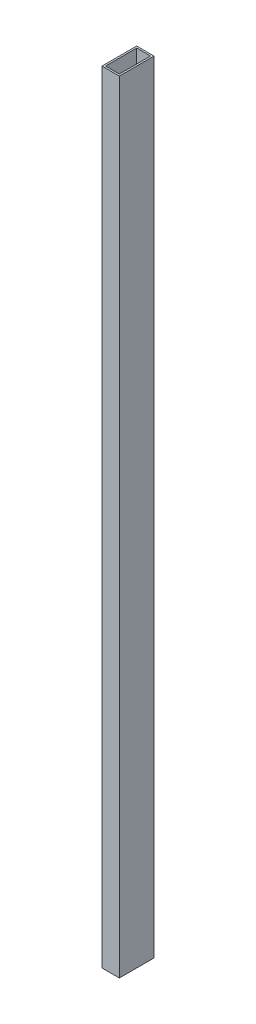
ISO-10303-21;
HEADER;
FILE_DESCRIPTION(('STEP AP214'),'2;1');
FILE_NAME('part.step','',(''),(''),'','','');
FILE_SCHEMA(('AUTOMOTIVE_DESIGN { 1 0 10303 214 1 1 1 1 }'));
ENDSEC;
DATA;
#1=APPLICATION_CONTEXT('core data for automotive mechanical design processes');
#2=APPLICATION_PROTOCOL_DEFINITION('international standard','automotive_design',2000,#1);
#3=PRODUCT_CONTEXT('',#1,'mechanical');
#4=PRODUCT('Part','Part','',(#3));
#5=PRODUCT_RELATED_PRODUCT_CATEGORY('part','',(#4));
#6=PRODUCT_DEFINITION_FORMATION('','',#4);
#7=PRODUCT_DEFINITION_CONTEXT('part definition',#1,'design');
#8=PRODUCT_DEFINITION('design','',#6,#7);
#9=PRODUCT_DEFINITION_SHAPE('','',#8);
#10=(LENGTH_UNIT() NAMED_UNIT(*) SI_UNIT(.MILLI.,.METRE.));
#11=(NAMED_UNIT(*) PLANE_ANGLE_UNIT() SI_UNIT($,.RADIAN.));
#12=(NAMED_UNIT(*) SI_UNIT($,.STERADIAN.) SOLID_ANGLE_UNIT());
#13=UNCERTAINTY_MEASURE_WITH_UNIT(LENGTH_MEASURE(1.E-05),#10,'distance_accuracy_value','');
#14=(GEOMETRIC_REPRESENTATION_CONTEXT(3) GLOBAL_UNCERTAINTY_ASSIGNED_CONTEXT((#13)) GLOBAL_UNIT_ASSIGNED_CONTEXT((#10,
#11,#12)) REPRESENTATION_CONTEXT('',''));
#15=CARTESIAN_POINT('',(0.,0.,0.));
#16=DIRECTION('',(0.,0.,1.));
#17=DIRECTION('',(1.,0.,0.));
#18=AXIS2_PLACEMENT_3D('',#15,#16,#17);
#19=CARTESIAN_POINT('',(0.,450.,0.));
#20=DIRECTION('',(0.,1.,0.));
#21=DIRECTION('',(0.,0.,1.));
#22=AXIS2_PLACEMENT_3D('',#19,#20,#21);
#23=PLANE('',#22);
#24=DIRECTION('',(0.,0.,1.));
#25=VECTOR('',#24,1.);
#26=CARTESIAN_POINT('',(-5.,450.,10.));
#27=LINE('',#26,#25);
#28=CARTESIAN_POINT('',(-5.,450.,-9.99999999999999));
#29=VERTEX_POINT('',#28);
#30=CARTESIAN_POINT('',(-5.,450.,10.));
#31=VERTEX_POINT('',#30);
#32=EDGE_CURVE('E136',#29,#31,#27,.T.);
#33=ORIENTED_EDGE('',*,*,#32,.T.);
#34=DIRECTION('',(1.,0.,0.));
#35=VECTOR('',#34,1.);
#36=CARTESIAN_POINT('',(5.,450.,10.));
#37=LINE('',#36,#35);
#38=CARTESIAN_POINT('',(5.,450.,10.));
#39=VERTEX_POINT('',#38);
#40=EDGE_CURVE('E139',#31,#39,#37,.T.);
#41=ORIENTED_EDGE('',*,*,#40,.T.);
#42=DIRECTION('',(0.,0.,-1.));
#43=VECTOR('',#42,1.);
#44=CARTESIAN_POINT('',(5.,450.,10.));
#45=LINE('',#44,#43);
#46=CARTESIAN_POINT('',(5.,450.,-10.));
#47=VERTEX_POINT('',#46);
#48=EDGE_CURVE('E142',#39,#47,#45,.T.);
#49=ORIENTED_EDGE('',*,*,#48,.T.);
#50=DIRECTION('',(-1.,0.,0.));
#51=VECTOR('',#50,1.);
#52=CARTESIAN_POINT('',(5.,450.,-10.));
#53=LINE('',#52,#51);
#54=EDGE_CURVE('E144',#47,#29,#53,.T.);
#55=ORIENTED_EDGE('',*,*,#54,.T.);
#56=EDGE_LOOP('',(#33,#41,#49,#55));
#57=FACE_BOUND('',#56,.T.);
#58=DIRECTION('',(1.,0.,0.));
#59=VECTOR('',#58,1.);
#60=CARTESIAN_POINT('',(4.,450.,9.));
#61=LINE('',#60,#59);
#62=CARTESIAN_POINT('',(-4.,450.,9.));
#63=VERTEX_POINT('',#62);
#64=CARTESIAN_POINT('',(4.,450.,9.));
#65=VERTEX_POINT('',#64);
#66=EDGE_CURVE('E108',#63,#65,#61,.T.);
#67=ORIENTED_EDGE('',*,*,#66,.F.);
#68=DIRECTION('',(0.,0.,1.));
#69=VECTOR('',#68,1.);
#70=CARTESIAN_POINT('',(-4.,450.,9.));
#71=LINE('',#70,#69);
#72=CARTESIAN_POINT('',(-4.,450.,-9.));
#73=VERTEX_POINT('',#72);
#74=EDGE_CURVE('E100',#73,#63,#71,.T.);
#75=ORIENTED_EDGE('',*,*,#74,.F.);
#76=DIRECTION('',(-1.,0.,0.));
#77=VECTOR('',#76,1.);
#78=CARTESIAN_POINT('',(4.,450.,-9.));
#79=LINE('',#78,#77);
#80=CARTESIAN_POINT('',(4.,450.,-9.));
#81=VERTEX_POINT('',#80);
#82=EDGE_CURVE('E122',#81,#73,#79,.T.);
#83=ORIENTED_EDGE('',*,*,#82,.F.);
#84=DIRECTION('',(0.,0.,-1.));
#85=VECTOR('',#84,1.);
#86=CARTESIAN_POINT('',(4.,450.,9.));
#87=LINE('',#86,#85);
#88=EDGE_CURVE('E120',#65,#81,#87,.T.);
#89=ORIENTED_EDGE('',*,*,#88,.F.);
#90=EDGE_LOOP('',(#67,#75,#83,#89));
#91=FACE_BOUND('',#90,.T.);
#92=ADVANCED_FACE('F35',(#57,#91),#23,.T.);
#93=CARTESIAN_POINT('',(0.,0.,0.));
#94=DIRECTION('',(0.,1.,0.));
#95=DIRECTION('',(0.,0.,1.));
#96=AXIS2_PLACEMENT_3D('',#93,#94,#95);
#97=PLANE('',#96);
#98=DIRECTION('',(0.,0.,1.));
#99=VECTOR('',#98,1.);
#100=CARTESIAN_POINT('',(-5.,0.,10.));
#101=LINE('',#100,#99);
#102=CARTESIAN_POINT('',(-5.,0.,-9.99999999999999));
#103=VERTEX_POINT('',#102);
#104=CARTESIAN_POINT('',(-5.,0.,10.));
#105=VERTEX_POINT('',#104);
#106=EDGE_CURVE('E116',#103,#105,#101,.T.);
#107=ORIENTED_EDGE('',*,*,#106,.F.);
#108=DIRECTION('',(-1.,0.,0.));
#109=VECTOR('',#108,1.);
#110=CARTESIAN_POINT('',(5.,0.,-10.));
#111=LINE('',#110,#109);
#112=CARTESIAN_POINT('',(5.,0.,-10.));
#113=VERTEX_POINT('',#112);
#114=EDGE_CURVE('E140',#113,#103,#111,.T.);
#115=ORIENTED_EDGE('',*,*,#114,.F.);
#116=DIRECTION('',(0.,0.,-1.));
#117=VECTOR('',#116,1.);
#118=CARTESIAN_POINT('',(5.,0.,10.));
#119=LINE('',#118,#117);
#120=CARTESIAN_POINT('',(5.,0.,10.));
#121=VERTEX_POINT('',#120);
#122=EDGE_CURVE('E151',#121,#113,#119,.T.);
#123=ORIENTED_EDGE('',*,*,#122,.F.);
#124=DIRECTION('',(1.,0.,0.));
#125=VECTOR('',#124,1.);
#126=CARTESIAN_POINT('',(5.,0.,10.));
#127=LINE('',#126,#125);
#128=EDGE_CURVE('E149',#105,#121,#127,.T.);
#129=ORIENTED_EDGE('',*,*,#128,.F.);
#130=EDGE_LOOP('',(#107,#115,#123,#129));
#131=FACE_BOUND('',#130,.T.);
#132=DIRECTION('',(0.,0.,1.));
#133=VECTOR('',#132,1.);
#134=CARTESIAN_POINT('',(-4.,0.,9.));
#135=LINE('',#134,#133);
#136=CARTESIAN_POINT('',(-4.,0.,-9.));
#137=VERTEX_POINT('',#136);
#138=CARTESIAN_POINT('',(-4.,0.,9.));
#139=VERTEX_POINT('',#138);
#140=EDGE_CURVE('E58',#137,#139,#135,.T.);
#141=ORIENTED_EDGE('',*,*,#140,.T.);
#142=DIRECTION('',(1.,0.,0.));
#143=VECTOR('',#142,1.);
#144=CARTESIAN_POINT('',(4.,0.,9.));
#145=LINE('',#144,#143);
#146=CARTESIAN_POINT('',(4.,0.,9.));
#147=VERTEX_POINT('',#146);
#148=EDGE_CURVE('E115',#139,#147,#145,.T.);
#149=ORIENTED_EDGE('',*,*,#148,.T.);
#150=DIRECTION('',(0.,0.,-1.));
#151=VECTOR('',#150,1.);
#152=CARTESIAN_POINT('',(4.,0.,9.));
#153=LINE('',#152,#151);
#154=CARTESIAN_POINT('',(4.,0.,-9.));
#155=VERTEX_POINT('',#154);
#156=EDGE_CURVE('E128',#147,#155,#153,.T.);
#157=ORIENTED_EDGE('',*,*,#156,.T.);
#158=DIRECTION('',(-1.,0.,0.));
#159=VECTOR('',#158,1.);
#160=CARTESIAN_POINT('',(4.,0.,-9.));
#161=LINE('',#160,#159);
#162=EDGE_CURVE('E109',#155,#137,#161,.T.);
#163=ORIENTED_EDGE('',*,*,#162,.T.);
#164=EDGE_LOOP('',(#141,#149,#157,#163));
#165=FACE_BOUND('',#164,.T.);
#166=ADVANCED_FACE('F169',(#131,#165),#97,.F.);
#167=CARTESIAN_POINT('',(-5.,450.,10.));
#168=DIRECTION('',(1.,0.,0.));
#169=DIRECTION('',(0.,0.,-1.));
#170=AXIS2_PLACEMENT_3D('',#167,#168,#169);
#171=PLANE('',#170);
#172=ORIENTED_EDGE('',*,*,#106,.T.);
#173=DIRECTION('',(0.,-1.,0.));
#174=VECTOR('',#173,1.);
#175=CARTESIAN_POINT('',(-5.,450.,10.));
#176=LINE('',#175,#174);
#177=EDGE_CURVE('E11',#31,#105,#176,.T.);
#178=ORIENTED_EDGE('',*,*,#177,.F.);
#179=ORIENTED_EDGE('',*,*,#32,.F.);
#180=DIRECTION('',(0.,-1.,0.));
#181=VECTOR('',#180,1.);
#182=CARTESIAN_POINT('',(-5.,450.,-9.99999999999999));
#183=LINE('',#182,#181);
#184=EDGE_CURVE('E146',#29,#103,#183,.T.);
#185=ORIENTED_EDGE('',*,*,#184,.T.);
#186=EDGE_LOOP('',(#172,#178,#179,#185));
#187=FACE_BOUND('',#186,.T.);
#188=ADVANCED_FACE('F37',(#187),#171,.F.);
#189=CARTESIAN_POINT('',(5.,450.,10.));
#190=DIRECTION('',(0.,0.,-1.));
#191=DIRECTION('',(-1.,0.,0.));
#192=AXIS2_PLACEMENT_3D('',#189,#190,#191);
#193=PLANE('',#192);
#194=ORIENTED_EDGE('',*,*,#128,.T.);
#195=DIRECTION('',(0.,-1.,0.));
#196=VECTOR('',#195,1.);
#197=CARTESIAN_POINT('',(5.,450.,10.));
#198=LINE('',#197,#196);
#199=EDGE_CURVE('E43',#39,#121,#198,.T.);
#200=ORIENTED_EDGE('',*,*,#199,.F.);
#201=ORIENTED_EDGE('',*,*,#40,.F.);
#202=ORIENTED_EDGE('',*,*,#177,.T.);
#203=EDGE_LOOP('',(#194,#200,#201,#202));
#204=FACE_BOUND('',#203,.T.);
#205=ADVANCED_FACE('F179',(#204),#193,.F.);
#206=CARTESIAN_POINT('',(5.,450.,10.));
#207=DIRECTION('',(-1.,0.,0.));
#208=DIRECTION('',(0.,0.,1.));
#209=AXIS2_PLACEMENT_3D('',#206,#207,#208);
#210=PLANE('',#209);
#211=ORIENTED_EDGE('',*,*,#122,.T.);
#212=DIRECTION('',(0.,-1.,0.));
#213=VECTOR('',#212,1.);
#214=CARTESIAN_POINT('',(5.,450.,-10.));
#215=LINE('',#214,#213);
#216=EDGE_CURVE('E156',#47,#113,#215,.T.);
#217=ORIENTED_EDGE('',*,*,#216,.F.);
#218=ORIENTED_EDGE('',*,*,#48,.F.);
#219=ORIENTED_EDGE('',*,*,#199,.T.);
#220=EDGE_LOOP('',(#211,#217,#218,#219));
#221=FACE_BOUND('',#220,.T.);
#222=ADVANCED_FACE('F163',(#221),#210,.F.);
#223=CARTESIAN_POINT('',(5.,450.,-10.));
#224=DIRECTION('',(0.,0.,1.));
#225=DIRECTION('',(1.,0.,0.));
#226=AXIS2_PLACEMENT_3D('',#223,#224,#225);
#227=PLANE('',#226);
#228=ORIENTED_EDGE('',*,*,#114,.T.);
#229=ORIENTED_EDGE('',*,*,#184,.F.);
#230=ORIENTED_EDGE('',*,*,#54,.F.);
#231=ORIENTED_EDGE('',*,*,#216,.T.);
#232=EDGE_LOOP('',(#228,#229,#230,#231));
#233=FACE_BOUND('',#232,.T.);
#234=ADVANCED_FACE('F173',(#233),#227,.F.);
#235=CARTESIAN_POINT('',(-4.,450.,9.));
#236=DIRECTION('',(1.,0.,0.));
#237=DIRECTION('',(0.,0.,-1.));
#238=AXIS2_PLACEMENT_3D('',#235,#236,#237);
#239=PLANE('',#238);
#240=ORIENTED_EDGE('',*,*,#140,.F.);
#241=DIRECTION('',(0.,-1.,0.));
#242=VECTOR('',#241,1.);
#243=CARTESIAN_POINT('',(-4.,450.,-9.));
#244=LINE('',#243,#242);
#245=EDGE_CURVE('E104',#73,#137,#244,.T.);
#246=ORIENTED_EDGE('',*,*,#245,.F.);
#247=ORIENTED_EDGE('',*,*,#74,.T.);
#248=DIRECTION('',(0.,-1.,0.));
#249=VECTOR('',#248,1.);
#250=CARTESIAN_POINT('',(-4.,450.,9.));
#251=LINE('',#250,#249);
#252=EDGE_CURVE('E103',#63,#139,#251,.T.);
#253=ORIENTED_EDGE('',*,*,#252,.T.);
#254=EDGE_LOOP('',(#240,#246,#247,#253));
#255=FACE_BOUND('',#254,.T.);
#256=ADVANCED_FACE('F102',(#255),#239,.T.);
#257=CARTESIAN_POINT('',(4.,450.,9.));
#258=DIRECTION('',(0.,0.,-1.));
#259=DIRECTION('',(-1.,0.,0.));
#260=AXIS2_PLACEMENT_3D('',#257,#258,#259);
#261=PLANE('',#260);
#262=ORIENTED_EDGE('',*,*,#148,.F.);
#263=ORIENTED_EDGE('',*,*,#252,.F.);
#264=ORIENTED_EDGE('',*,*,#66,.T.);
#265=DIRECTION('',(0.,-1.,0.));
#266=VECTOR('',#265,1.);
#267=CARTESIAN_POINT('',(4.,450.,9.));
#268=LINE('',#267,#266);
#269=EDGE_CURVE('E117',#65,#147,#268,.T.);
#270=ORIENTED_EDGE('',*,*,#269,.T.);
#271=EDGE_LOOP('',(#262,#263,#264,#270));
#272=FACE_BOUND('',#271,.T.);
#273=ADVANCED_FACE('F112',(#272),#261,.T.);
#274=CARTESIAN_POINT('',(4.,450.,9.));
#275=DIRECTION('',(-1.,0.,0.));
#276=DIRECTION('',(0.,0.,1.));
#277=AXIS2_PLACEMENT_3D('',#274,#275,#276);
#278=PLANE('',#277);
#279=ORIENTED_EDGE('',*,*,#156,.F.);
#280=ORIENTED_EDGE('',*,*,#269,.F.);
#281=ORIENTED_EDGE('',*,*,#88,.T.);
#282=DIRECTION('',(0.,-1.,0.));
#283=VECTOR('',#282,1.);
#284=CARTESIAN_POINT('',(4.,450.,-9.));
#285=LINE('',#284,#283);
#286=EDGE_CURVE('E50',#81,#155,#285,.T.);
#287=ORIENTED_EDGE('',*,*,#286,.T.);
#288=EDGE_LOOP('',(#279,#280,#281,#287));
#289=FACE_BOUND('',#288,.T.);
#290=ADVANCED_FACE('F202',(#289),#278,.T.);
#291=CARTESIAN_POINT('',(4.,450.,-9.));
#292=DIRECTION('',(0.,0.,1.));
#293=DIRECTION('',(1.,0.,0.));
#294=AXIS2_PLACEMENT_3D('',#291,#292,#293);
#295=PLANE('',#294);
#296=ORIENTED_EDGE('',*,*,#162,.F.);
#297=ORIENTED_EDGE('',*,*,#286,.F.);
#298=ORIENTED_EDGE('',*,*,#82,.T.);
#299=ORIENTED_EDGE('',*,*,#245,.T.);
#300=EDGE_LOOP('',(#296,#297,#298,#299));
#301=FACE_BOUND('',#300,.T.);
#302=ADVANCED_FACE('F206',(#301),#295,.T.);
#303=CLOSED_SHELL('',(#92,#166,#188,#205,#222,#234,#256,#273,#290,#302));
#304=MANIFOLD_SOLID_BREP('B2',#303);
#305=ADVANCED_BREP_SHAPE_REPRESENTATION('',(#18,#304),#14);
#306=SHAPE_DEFINITION_REPRESENTATION(#9,#305);
ENDSEC;
END-ISO-10303-21;
